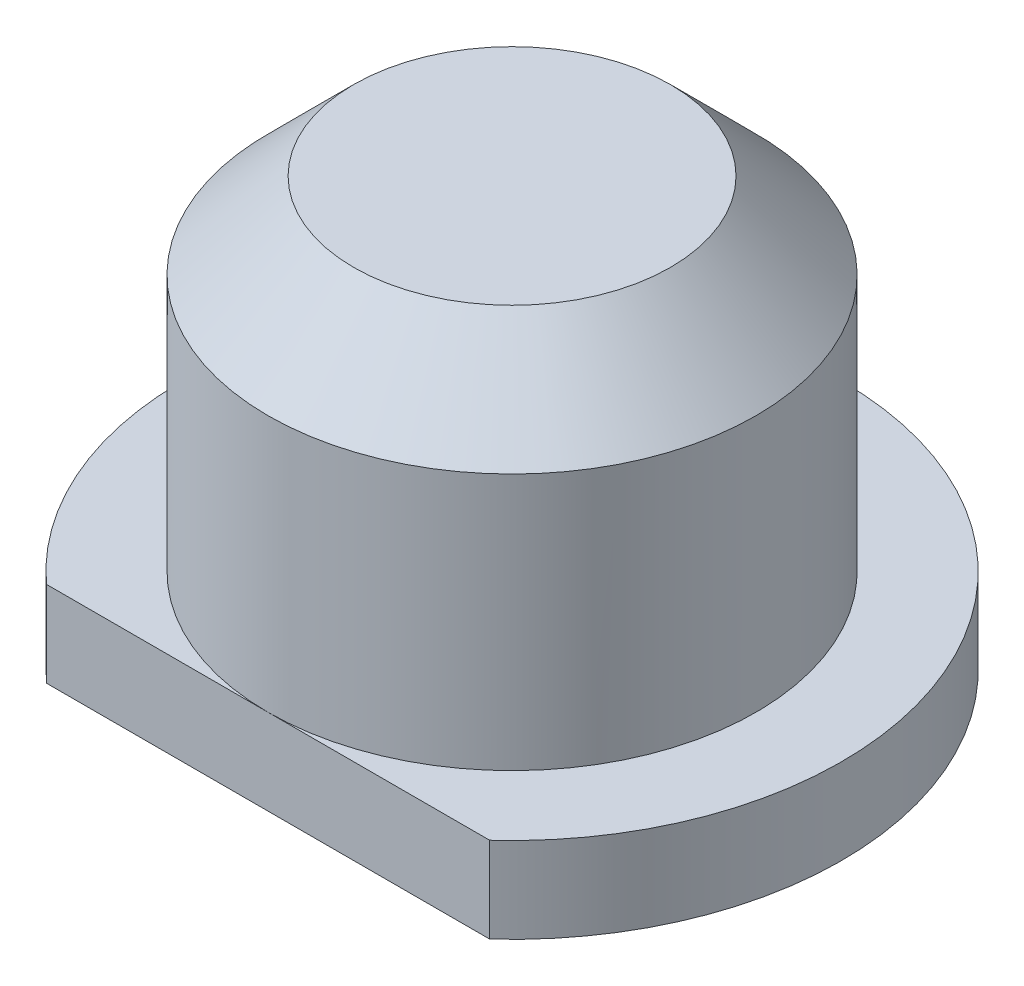
ISO-10303-21;
HEADER;
FILE_DESCRIPTION(('STEP AP214'),'2;1');
FILE_NAME('part.step','',(''),(''),'','','');
FILE_SCHEMA(('AUTOMOTIVE_DESIGN { 1 0 10303 214 1 1 1 1 }'));
ENDSEC;
DATA;
#1=APPLICATION_CONTEXT('core data for automotive mechanical design processes');
#2=APPLICATION_PROTOCOL_DEFINITION('international standard','automotive_design',2000,#1);
#3=PRODUCT_CONTEXT('',#1,'mechanical');
#4=PRODUCT('Part','Part','',(#3));
#5=PRODUCT_RELATED_PRODUCT_CATEGORY('part','',(#4));
#6=PRODUCT_DEFINITION_FORMATION('','',#4);
#7=PRODUCT_DEFINITION_CONTEXT('part definition',#1,'design');
#8=PRODUCT_DEFINITION('design','',#6,#7);
#9=PRODUCT_DEFINITION_SHAPE('','',#8);
#10=(LENGTH_UNIT() NAMED_UNIT(*) SI_UNIT(.MILLI.,.METRE.));
#11=(NAMED_UNIT(*) PLANE_ANGLE_UNIT() SI_UNIT($,.RADIAN.));
#12=(NAMED_UNIT(*) SI_UNIT($,.STERADIAN.) SOLID_ANGLE_UNIT());
#13=UNCERTAINTY_MEASURE_WITH_UNIT(LENGTH_MEASURE(1.E-05),#10,'distance_accuracy_value','');
#14=(GEOMETRIC_REPRESENTATION_CONTEXT(3) GLOBAL_UNCERTAINTY_ASSIGNED_CONTEXT((#13)) GLOBAL_UNIT_ASSIGNED_CONTEXT((#10,
#11,#12)) REPRESENTATION_CONTEXT('',''));
#15=CARTESIAN_POINT('',(0.,0.,0.));
#16=DIRECTION('',(0.,0.,1.));
#17=DIRECTION('',(1.,0.,0.));
#18=AXIS2_PLACEMENT_3D('',#15,#16,#17);
#19=CARTESIAN_POINT('',(0.,3.5,0.));
#20=DIRECTION('',(0.,1.,0.));
#21=DIRECTION('',(-1.,0.,0.));
#22=AXIS2_PLACEMENT_3D('',#19,#20,#21);
#23=PLANE('',#22);
#24=CARTESIAN_POINT('',(0.,3.5,0.));
#25=DIRECTION('',(0.,1.,0.));
#26=DIRECTION('',(-1.,0.,0.));
#27=AXIS2_PLACEMENT_3D('',#24,#25,#26);
#28=CIRCLE('',#27,2.);
#29=CARTESIAN_POINT('',(-2.,3.5,0.));
#30=VERTEX_POINT('',#29);
#31=EDGE_CURVE('E87',#30,#30,#28,.T.);
#32=ORIENTED_EDGE('',*,*,#31,.F.);
#33=EDGE_LOOP('',(#32));
#34=FACE_BOUND('',#33,.T.);
#35=ADVANCED_FACE('F37',(#34),#23,.F.);
#36=CARTESIAN_POINT('',(0.,3.5,0.));
#37=DIRECTION('',(0.,1.,0.));
#38=DIRECTION('',(-1.,0.,0.));
#39=AXIS2_PLACEMENT_3D('',#36,#37,#38);
#40=CYLINDRICAL_SURFACE('',#39,2.);
#41=CARTESIAN_POINT('',(0.,0.,0.));
#42=DIRECTION('',(0.,1.,0.));
#43=DIRECTION('',(-1.,0.,0.));
#44=AXIS2_PLACEMENT_3D('',#41,#42,#43);
#45=CIRCLE('',#44,2.);
#46=CARTESIAN_POINT('',(-2.,0.,0.));
#47=VERTEX_POINT('',#46);
#48=EDGE_CURVE('E83',#47,#47,#45,.T.);
#49=ORIENTED_EDGE('',*,*,#48,.F.);
#50=EDGE_LOOP('',(#49));
#51=FACE_BOUND('',#50,.T.);
#52=ORIENTED_EDGE('',*,*,#31,.T.);
#53=EDGE_LOOP('',(#52));
#54=FACE_BOUND('',#53,.T.);
#55=ADVANCED_FACE('F110',(#51,#54),#40,.F.);
#56=CARTESIAN_POINT('',(2.,0.,0.));
#57=DIRECTION('',(0.,1.,0.));
#58=DIRECTION('',(-1.,0.,0.));
#59=AXIS2_PLACEMENT_3D('',#56,#57,#58);
#60=PLANE('',#59);
#61=CARTESIAN_POINT('',(0.,0.,0.));
#62=DIRECTION('',(0.,1.,0.));
#63=DIRECTION('',(-1.,0.,0.));
#64=AXIS2_PLACEMENT_3D('',#61,#62,#63);
#65=CIRCLE('',#64,3.85);
#66=CARTESIAN_POINT('',(2.58843582110895,0.,2.85));
#67=VERTEX_POINT('',#66);
#68=CARTESIAN_POINT('',(-2.58843582110895,0.,2.85));
#69=VERTEX_POINT('',#68);
#70=EDGE_CURVE('E79',#67,#69,#65,.T.);
#71=ORIENTED_EDGE('',*,*,#70,.F.);
#72=DIRECTION('',(-1.,0.,0.));
#73=VECTOR('',#72,1.);
#74=CARTESIAN_POINT('',(-2.58843582110895,0.,2.85));
#75=LINE('',#74,#73);
#76=EDGE_CURVE('E58',#67,#69,#75,.T.);
#77=ORIENTED_EDGE('',*,*,#76,.T.);
#78=EDGE_LOOP('',(#71,#77));
#79=FACE_BOUND('',#78,.T.);
#80=ORIENTED_EDGE('',*,*,#48,.T.);
#81=EDGE_LOOP('',(#80));
#82=FACE_BOUND('',#81,.T.);
#83=ADVANCED_FACE('F77',(#79,#82),#60,.F.);
#84=CARTESIAN_POINT('',(0.,3.5,0.));
#85=DIRECTION('',(0.,1.,0.));
#86=DIRECTION('',(-1.,0.,0.));
#87=AXIS2_PLACEMENT_3D('',#84,#85,#86);
#88=CYLINDRICAL_SURFACE('',#87,3.85);
#89=ORIENTED_EDGE('',*,*,#70,.T.);
#90=DIRECTION('',(0.,1.,0.));
#91=VECTOR('',#90,1.);
#92=CARTESIAN_POINT('',(-2.58843582110895,0.,2.85));
#93=LINE('',#92,#91);
#94=CARTESIAN_POINT('',(-2.58843582110895,1.,2.85));
#95=VERTEX_POINT('',#94);
#96=EDGE_CURVE('E66',#69,#95,#93,.T.);
#97=ORIENTED_EDGE('',*,*,#96,.T.);
#98=CARTESIAN_POINT('',(0.,1.,0.));
#99=DIRECTION('',(0.,1.,0.));
#100=DIRECTION('',(-1.,0.,0.));
#101=AXIS2_PLACEMENT_3D('',#98,#99,#100);
#102=CIRCLE('',#101,3.85);
#103=CARTESIAN_POINT('',(2.58843582110895,1.,2.85));
#104=VERTEX_POINT('',#103);
#105=EDGE_CURVE('E84',#104,#95,#102,.T.);
#106=ORIENTED_EDGE('',*,*,#105,.F.);
#107=DIRECTION('',(0.,1.,0.));
#108=VECTOR('',#107,1.);
#109=CARTESIAN_POINT('',(2.58843582110895,3.5,2.85));
#110=LINE('',#109,#108);
#111=EDGE_CURVE('E53',#104,#67,#110,.F.);
#112=ORIENTED_EDGE('',*,*,#111,.T.);
#113=EDGE_LOOP('',(#89,#97,#106,#112));
#114=FACE_BOUND('',#113,.T.);
#115=ADVANCED_FACE('F82',(#114),#88,.T.);
#116=CARTESIAN_POINT('',(3.85,1.,0.));
#117=DIRECTION('',(0.,-1.,0.));
#118=DIRECTION('',(1.,0.,0.));
#119=AXIS2_PLACEMENT_3D('',#116,#117,#118);
#120=PLANE('',#119);
#121=ORIENTED_EDGE('',*,*,#105,.T.);
#122=DIRECTION('',(-1.,0.,0.));
#123=VECTOR('',#122,1.);
#124=CARTESIAN_POINT('',(-2.58843582110895,1.,2.85));
#125=LINE('',#124,#123);
#126=CARTESIAN_POINT('',(0.,1.,2.85));
#127=VERTEX_POINT('',#126);
#128=EDGE_CURVE('E69',#127,#95,#125,.T.);
#129=ORIENTED_EDGE('',*,*,#128,.F.);
#130=CARTESIAN_POINT('',(0.,1.,0.));
#131=DIRECTION('',(0.,1.,0.));
#132=DIRECTION('',(-1.,0.,0.));
#133=AXIS2_PLACEMENT_3D('',#130,#131,#132);
#134=CIRCLE('',#133,2.85);
#135=EDGE_CURVE('E89',#127,#127,#134,.T.);
#136=ORIENTED_EDGE('',*,*,#135,.F.);
#137=EDGE_CURVE('E80',#104,#127,#125,.T.);
#138=ORIENTED_EDGE('',*,*,#137,.F.);
#139=EDGE_LOOP('',(#121,#129,#136,#138));
#140=FACE_BOUND('',#139,.T.);
#141=ADVANCED_FACE('F123',(#140),#120,.F.);
#142=CARTESIAN_POINT('',(0.,3.5,0.));
#143=DIRECTION('',(0.,1.,0.));
#144=DIRECTION('',(-1.,0.,0.));
#145=AXIS2_PLACEMENT_3D('',#142,#143,#144);
#146=CYLINDRICAL_SURFACE('',#145,2.85);
#147=CARTESIAN_POINT('',(0.,4.,0.));
#148=DIRECTION('',(0.,-1.,0.));
#149=DIRECTION('',(1.,0.,0.));
#150=AXIS2_PLACEMENT_3D('',#147,#148,#149);
#151=CIRCLE('',#150,2.85);
#152=CARTESIAN_POINT('',(2.85,4.,0.));
#153=VERTEX_POINT('',#152);
#154=EDGE_CURVE('E11',#153,#153,#151,.T.);
#155=ORIENTED_EDGE('',*,*,#154,.T.);
#156=EDGE_LOOP('',(#155));
#157=FACE_BOUND('',#156,.T.);
#158=ORIENTED_EDGE('',*,*,#135,.T.);
#159=EDGE_LOOP('',(#158));
#160=FACE_BOUND('',#159,.T.);
#161=ADVANCED_FACE('F106',(#157,#160),#146,.T.);
#162=CARTESIAN_POINT('',(2.85,5.,0.));
#163=DIRECTION('',(0.,-1.,0.));
#164=DIRECTION('',(1.,0.,0.));
#165=AXIS2_PLACEMENT_3D('',#162,#163,#164);
#166=PLANE('',#165);
#167=CARTESIAN_POINT('',(0.,5.,0.));
#168=DIRECTION('',(0.,-1.,0.));
#169=DIRECTION('',(1.,0.,0.));
#170=AXIS2_PLACEMENT_3D('',#167,#168,#169);
#171=CIRCLE('',#170,1.85);
#172=CARTESIAN_POINT('',(1.85,5.,0.));
#173=VERTEX_POINT('',#172);
#174=EDGE_CURVE('E46',#173,#173,#171,.F.);
#175=ORIENTED_EDGE('',*,*,#174,.T.);
#176=EDGE_LOOP('',(#175));
#177=FACE_BOUND('',#176,.T.);
#178=ADVANCED_FACE('F97',(#177),#166,.F.);
#179=CARTESIAN_POINT('',(0.,5.,0.));
#180=DIRECTION('',(0.,-1.,0.));
#181=DIRECTION('',(1.,0.,0.));
#182=AXIS2_PLACEMENT_3D('',#179,#180,#181);
#183=CONICAL_SURFACE('',#182,1.85,0.785398163397446);
#184=ORIENTED_EDGE('',*,*,#154,.F.);
#185=EDGE_LOOP('',(#184));
#186=FACE_BOUND('',#185,.T.);
#187=ORIENTED_EDGE('',*,*,#174,.F.);
#188=EDGE_LOOP('',(#187));
#189=FACE_BOUND('',#188,.T.);
#190=ADVANCED_FACE('F40',(#186,#189),#183,.T.);
#191=CARTESIAN_POINT('',(-2.58843582110895,0.,2.85));
#192=DIRECTION('',(0.,0.,-1.));
#193=DIRECTION('',(-1.,0.,0.));
#194=AXIS2_PLACEMENT_3D('',#191,#192,#193);
#195=PLANE('',#194);
#196=ORIENTED_EDGE('',*,*,#137,.T.);
#197=ORIENTED_EDGE('',*,*,#128,.T.);
#198=ORIENTED_EDGE('',*,*,#96,.F.);
#199=ORIENTED_EDGE('',*,*,#76,.F.);
#200=ORIENTED_EDGE('',*,*,#111,.F.);
#201=EDGE_LOOP('',(#196,#197,#198,#199,#200));
#202=FACE_BOUND('',#201,.T.);
#203=ADVANCED_FACE('F67',(#202),#195,.F.);
#204=CLOSED_SHELL('',(#35,#55,#83,#115,#141,#161,#178,#190,#203));
#205=MANIFOLD_SOLID_BREP('B2',#204);
#206=ADVANCED_BREP_SHAPE_REPRESENTATION('',(#18,#205),#14);
#207=SHAPE_DEFINITION_REPRESENTATION(#9,#206);
ENDSEC;
END-ISO-10303-21;
